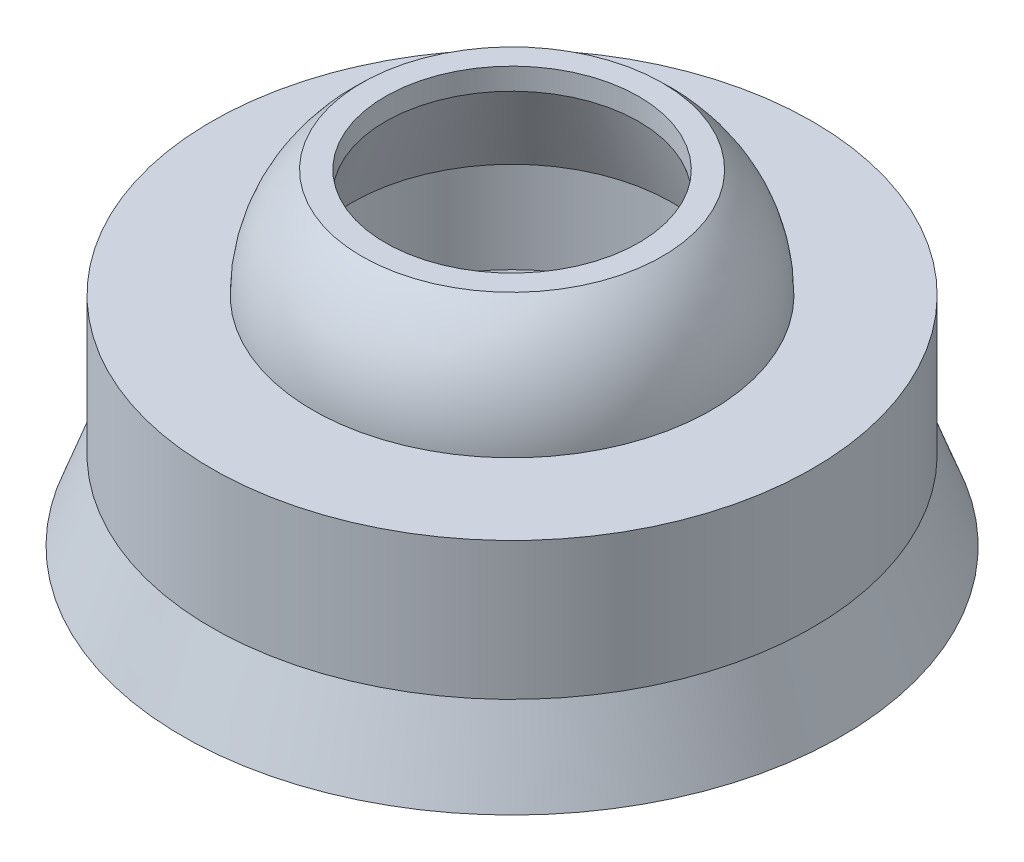
ISO-10303-21;
HEADER;
FILE_DESCRIPTION(('STEP AP214'),'2;1');
FILE_NAME('part.step','',(''),(''),'','','');
FILE_SCHEMA(('AUTOMOTIVE_DESIGN { 1 0 10303 214 1 1 1 1 }'));
ENDSEC;
DATA;
#1=APPLICATION_CONTEXT('core data for automotive mechanical design processes');
#2=APPLICATION_PROTOCOL_DEFINITION('international standard','automotive_design',2000,#1);
#3=PRODUCT_CONTEXT('',#1,'mechanical');
#4=PRODUCT('Part','Part','',(#3));
#5=PRODUCT_RELATED_PRODUCT_CATEGORY('part','',(#4));
#6=PRODUCT_DEFINITION_FORMATION('','',#4);
#7=PRODUCT_DEFINITION_CONTEXT('part definition',#1,'design');
#8=PRODUCT_DEFINITION('design','',#6,#7);
#9=PRODUCT_DEFINITION_SHAPE('','',#8);
#10=(LENGTH_UNIT() NAMED_UNIT(*) SI_UNIT(.MILLI.,.METRE.));
#11=(NAMED_UNIT(*) PLANE_ANGLE_UNIT() SI_UNIT($,.RADIAN.));
#12=(NAMED_UNIT(*) SI_UNIT($,.STERADIAN.) SOLID_ANGLE_UNIT());
#13=UNCERTAINTY_MEASURE_WITH_UNIT(LENGTH_MEASURE(1.E-05),#10,'distance_accuracy_value','');
#14=(GEOMETRIC_REPRESENTATION_CONTEXT(3) GLOBAL_UNCERTAINTY_ASSIGNED_CONTEXT((#13)) GLOBAL_UNIT_ASSIGNED_CONTEXT((#10,
#11,#12)) REPRESENTATION_CONTEXT('',''));
#15=CARTESIAN_POINT('',(0.,0.,0.));
#16=DIRECTION('',(0.,0.,1.));
#17=DIRECTION('',(1.,0.,0.));
#18=AXIS2_PLACEMENT_3D('',#15,#16,#17);
#19=CARTESIAN_POINT('',(0.,-1.9,0.));
#20=DIRECTION('',(0.,-1.,0.));
#21=DIRECTION('',(0.,0.,-1.));
#22=AXIS2_PLACEMENT_3D('',#19,#20,#21);
#23=CONICAL_SURFACE('',#22,4.15,0.348771003583907);
#24=CARTESIAN_POINT('',(0.,-3.,0.));
#25=DIRECTION('',(0.,-1.,0.));
#26=DIRECTION('',(0.,0.,-1.));
#27=AXIS2_PLACEMENT_3D('',#24,#25,#26);
#28=CIRCLE('',#27,4.55);
#29=CARTESIAN_POINT('',(0.,-3.,-4.55));
#30=VERTEX_POINT('',#29);
#31=EDGE_CURVE('E78',#30,#30,#28,.T.);
#32=ORIENTED_EDGE('',*,*,#31,.F.);
#33=EDGE_LOOP('',(#32));
#34=FACE_BOUND('',#33,.T.);
#35=CARTESIAN_POINT('',(0.,-1.9,0.));
#36=DIRECTION('',(0.,-1.,0.));
#37=DIRECTION('',(0.,0.,-1.));
#38=AXIS2_PLACEMENT_3D('',#35,#36,#37);
#39=CIRCLE('',#38,4.15);
#40=CARTESIAN_POINT('',(0.,-1.9,-4.15));
#41=VERTEX_POINT('',#40);
#42=EDGE_CURVE('E10',#41,#41,#39,.T.);
#43=ORIENTED_EDGE('',*,*,#42,.T.);
#44=EDGE_LOOP('',(#43));
#45=FACE_BOUND('',#44,.T.);
#46=ADVANCED_FACE('F32',(#34,#45),#23,.T.);
#47=CARTESIAN_POINT('',(0.,0.,0.));
#48=DIRECTION('',(0.,-1.,0.));
#49=DIRECTION('',(0.,0.,-1.));
#50=AXIS2_PLACEMENT_3D('',#47,#48,#49);
#51=CYLINDRICAL_SURFACE('',#50,4.15);
#52=ORIENTED_EDGE('',*,*,#42,.F.);
#53=EDGE_LOOP('',(#52));
#54=FACE_BOUND('',#53,.T.);
#55=CARTESIAN_POINT('',(0.,0.,0.));
#56=DIRECTION('',(0.,-1.,0.));
#57=DIRECTION('',(0.,0.,-1.));
#58=AXIS2_PLACEMENT_3D('',#55,#56,#57);
#59=CIRCLE('',#58,4.15);
#60=CARTESIAN_POINT('',(0.,0.,-4.15));
#61=VERTEX_POINT('',#60);
#62=EDGE_CURVE('E38',#61,#61,#59,.T.);
#63=ORIENTED_EDGE('',*,*,#62,.T.);
#64=EDGE_LOOP('',(#63));
#65=FACE_BOUND('',#64,.T.);
#66=ADVANCED_FACE('F85',(#54,#65),#51,.T.);
#67=CARTESIAN_POINT('',(0.,0.,4.15));
#68=DIRECTION('',(0.,-1.,0.));
#69=DIRECTION('',(0.,0.,-1.));
#70=AXIS2_PLACEMENT_3D('',#67,#68,#69);
#71=PLANE('',#70);
#72=ORIENTED_EDGE('',*,*,#62,.F.);
#73=EDGE_LOOP('',(#72));
#74=FACE_BOUND('',#73,.T.);
#75=CARTESIAN_POINT('',(0.,0.,0.));
#76=DIRECTION('',(0.,-1.,0.));
#77=DIRECTION('',(0.,0.,-1.));
#78=AXIS2_PLACEMENT_3D('',#75,#76,#77);
#79=CIRCLE('',#78,2.75212434446771);
#80=CARTESIAN_POINT('',(0.,0.,-2.75212434446771));
#81=VERTEX_POINT('',#80);
#82=EDGE_CURVE('E42',#81,#81,#79,.T.);
#83=ORIENTED_EDGE('',*,*,#82,.T.);
#84=EDGE_LOOP('',(#83));
#85=FACE_BOUND('',#84,.T.);
#86=ADVANCED_FACE('F89',(#74,#85),#71,.F.);
#87=CARTESIAN_POINT('',(0.,0.,0.));
#88=DIRECTION('',(0.,-1.,0.));
#89=DIRECTION('',(0.,0.,-1.));
#90=AXIS2_PLACEMENT_3D('',#87,#88,#89);
#91=DEGENERATE_TOROIDAL_SURFACE('',#90,0.752124344467705,2.,.T.);
#92=ORIENTED_EDGE('',*,*,#82,.F.);
#93=EDGE_LOOP('',(#92));
#94=FACE_BOUND('',#93,.T.);
#95=CARTESIAN_POINT('',(0.,1.5,0.));
#96=DIRECTION('',(0.,-1.,0.));
#97=DIRECTION('',(0.,0.,-1.));
#98=AXIS2_PLACEMENT_3D('',#95,#96,#97);
#99=CIRCLE('',#98,2.075);
#100=CARTESIAN_POINT('',(0.,1.5,-2.075));
#101=VERTEX_POINT('',#100);
#102=EDGE_CURVE('E46',#101,#101,#99,.T.);
#103=ORIENTED_EDGE('',*,*,#102,.T.);
#104=EDGE_LOOP('',(#103));
#105=FACE_BOUND('',#104,.T.);
#106=ADVANCED_FACE('F94',(#94,#105),#91,.T.);
#107=CARTESIAN_POINT('',(0.,1.5,2.075));
#108=DIRECTION('',(0.,-1.,0.));
#109=DIRECTION('',(0.,0.,-1.));
#110=AXIS2_PLACEMENT_3D('',#107,#108,#109);
#111=PLANE('',#110);
#112=ORIENTED_EDGE('',*,*,#102,.F.);
#113=EDGE_LOOP('',(#112));
#114=FACE_BOUND('',#113,.T.);
#115=CARTESIAN_POINT('',(0.,1.5,0.));
#116=DIRECTION('',(0.,-1.,0.));
#117=DIRECTION('',(0.,0.,-1.));
#118=AXIS2_PLACEMENT_3D('',#115,#116,#117);
#119=CIRCLE('',#118,1.75);
#120=CARTESIAN_POINT('',(0.,1.5,-1.75));
#121=VERTEX_POINT('',#120);
#122=EDGE_CURVE('E51',#121,#121,#119,.T.);
#123=ORIENTED_EDGE('',*,*,#122,.T.);
#124=EDGE_LOOP('',(#123));
#125=FACE_BOUND('',#124,.T.);
#126=ADVANCED_FACE('F100',(#114,#125),#111,.F.);
#127=CARTESIAN_POINT('',(0.,0.,0.));
#128=DIRECTION('',(0.,-1.,0.));
#129=DIRECTION('',(0.,0.,-1.));
#130=AXIS2_PLACEMENT_3D('',#127,#128,#129);
#131=CYLINDRICAL_SURFACE('',#130,1.75);
#132=ORIENTED_EDGE('',*,*,#122,.F.);
#133=EDGE_LOOP('',(#132));
#134=FACE_BOUND('',#133,.T.);
#135=CARTESIAN_POINT('',(0.,1.2,0.));
#136=DIRECTION('',(0.,-1.,0.));
#137=DIRECTION('',(0.,0.,-1.));
#138=AXIS2_PLACEMENT_3D('',#135,#136,#137);
#139=CIRCLE('',#138,1.75);
#140=CARTESIAN_POINT('',(0.,1.2,-1.75));
#141=VERTEX_POINT('',#140);
#142=EDGE_CURVE('E54',#141,#141,#139,.T.);
#143=ORIENTED_EDGE('',*,*,#142,.T.);
#144=EDGE_LOOP('',(#143));
#145=FACE_BOUND('',#144,.T.);
#146=ADVANCED_FACE('F104',(#134,#145),#131,.F.);
#147=CARTESIAN_POINT('',(0.,0.,0.));
#148=DIRECTION('',(0.,-1.,0.));
#149=DIRECTION('',(0.,0.,-1.));
#150=AXIS2_PLACEMENT_3D('',#147,#148,#149);
#151=CONICAL_SURFACE('',#150,2.21194690265487,0.367470305792931);
#152=ORIENTED_EDGE('',*,*,#142,.F.);
#153=EDGE_LOOP('',(#152));
#154=FACE_BOUND('',#153,.T.);
#155=CARTESIAN_POINT('',(0.,0.,0.));
#156=DIRECTION('',(0.,-1.,0.));
#157=DIRECTION('',(0.,0.,-1.));
#158=AXIS2_PLACEMENT_3D('',#155,#156,#157);
#159=CIRCLE('',#158,2.21194690265487);
#160=CARTESIAN_POINT('',(0.,0.,-2.21194690265487));
#161=VERTEX_POINT('',#160);
#162=EDGE_CURVE('E57',#161,#161,#159,.T.);
#163=ORIENTED_EDGE('',*,*,#162,.T.);
#164=EDGE_LOOP('',(#163));
#165=FACE_BOUND('',#164,.T.);
#166=ADVANCED_FACE('F108',(#154,#165),#151,.F.);
#167=CARTESIAN_POINT('',(0.,0.,0.));
#168=DIRECTION('',(0.,-1.,0.));
#169=DIRECTION('',(0.,0.,-1.));
#170=AXIS2_PLACEMENT_3D('',#167,#168,#169);
#171=CYLINDRICAL_SURFACE('',#170,2.21194690265487);
#172=ORIENTED_EDGE('',*,*,#162,.F.);
#173=EDGE_LOOP('',(#172));
#174=FACE_BOUND('',#173,.T.);
#175=CARTESIAN_POINT('',(0.,-1.26,0.));
#176=DIRECTION('',(0.,-1.,0.));
#177=DIRECTION('',(0.,0.,-1.));
#178=AXIS2_PLACEMENT_3D('',#175,#176,#177);
#179=CIRCLE('',#178,2.21194690265487);
#180=CARTESIAN_POINT('',(0.,-1.26,-2.21194690265487));
#181=VERTEX_POINT('',#180);
#182=EDGE_CURVE('E60',#181,#181,#179,.T.);
#183=ORIENTED_EDGE('',*,*,#182,.T.);
#184=EDGE_LOOP('',(#183));
#185=FACE_BOUND('',#184,.T.);
#186=ADVANCED_FACE('F112',(#174,#185),#171,.F.);
#187=CARTESIAN_POINT('',(0.,-2.13,0.));
#188=DIRECTION('',(0.,1.,0.));
#189=DIRECTION('',(0.,0.,1.));
#190=AXIS2_PLACEMENT_3D('',#187,#188,#189);
#191=CONICAL_SURFACE('',#190,1.75,0.488118247867343);
#192=ORIENTED_EDGE('',*,*,#182,.F.);
#193=EDGE_LOOP('',(#192));
#194=FACE_BOUND('',#193,.T.);
#195=CARTESIAN_POINT('',(0.,-2.13,0.));
#196=DIRECTION('',(0.,-1.,0.));
#197=DIRECTION('',(0.,0.,-1.));
#198=AXIS2_PLACEMENT_3D('',#195,#196,#197);
#199=CIRCLE('',#198,1.75);
#200=CARTESIAN_POINT('',(0.,-2.13,-1.75));
#201=VERTEX_POINT('',#200);
#202=EDGE_CURVE('E63',#201,#201,#199,.T.);
#203=ORIENTED_EDGE('',*,*,#202,.T.);
#204=EDGE_LOOP('',(#203));
#205=FACE_BOUND('',#204,.T.);
#206=ADVANCED_FACE('F116',(#194,#205),#191,.F.);
#207=CARTESIAN_POINT('',(0.,-2.63,0.));
#208=DIRECTION('',(0.,-1.,0.));
#209=DIRECTION('',(0.,0.,-1.));
#210=AXIS2_PLACEMENT_3D('',#207,#208,#209);
#211=CONICAL_SURFACE('',#210,2.25,0.785398163397449);
#212=ORIENTED_EDGE('',*,*,#202,.F.);
#213=EDGE_LOOP('',(#212));
#214=FACE_BOUND('',#213,.T.);
#215=CARTESIAN_POINT('',(0.,-2.63,0.));
#216=DIRECTION('',(0.,-1.,0.));
#217=DIRECTION('',(0.,0.,-1.));
#218=AXIS2_PLACEMENT_3D('',#215,#216,#217);
#219=CIRCLE('',#218,2.25);
#220=CARTESIAN_POINT('',(0.,-2.63,-2.25));
#221=VERTEX_POINT('',#220);
#222=EDGE_CURVE('E66',#221,#221,#219,.T.);
#223=ORIENTED_EDGE('',*,*,#222,.T.);
#224=EDGE_LOOP('',(#223));
#225=FACE_BOUND('',#224,.T.);
#226=ADVANCED_FACE('F120',(#214,#225),#211,.F.);
#227=CARTESIAN_POINT('',(0.,-1.5,0.));
#228=DIRECTION('',(0.,1.,0.));
#229=DIRECTION('',(0.,0.,1.));
#230=AXIS2_PLACEMENT_3D('',#227,#228,#229);
#231=CONICAL_SURFACE('',#230,2.85,0.488118247867343);
#232=ORIENTED_EDGE('',*,*,#222,.F.);
#233=EDGE_LOOP('',(#232));
#234=FACE_BOUND('',#233,.T.);
#235=CARTESIAN_POINT('',(0.,-1.5,0.));
#236=DIRECTION('',(0.,-1.,0.));
#237=DIRECTION('',(0.,0.,-1.));
#238=AXIS2_PLACEMENT_3D('',#235,#236,#237);
#239=CIRCLE('',#238,2.85);
#240=CARTESIAN_POINT('',(0.,-1.5,-2.85));
#241=VERTEX_POINT('',#240);
#242=EDGE_CURVE('E69',#241,#241,#239,.T.);
#243=ORIENTED_EDGE('',*,*,#242,.T.);
#244=EDGE_LOOP('',(#243));
#245=FACE_BOUND('',#244,.T.);
#246=ADVANCED_FACE('F124',(#234,#245),#231,.T.);
#247=CARTESIAN_POINT('',(0.,-1.5,2.85));
#248=DIRECTION('',(0.,1.,0.));
#249=DIRECTION('',(0.,0.,1.));
#250=AXIS2_PLACEMENT_3D('',#247,#248,#249);
#251=PLANE('',#250);
#252=ORIENTED_EDGE('',*,*,#242,.F.);
#253=EDGE_LOOP('',(#252));
#254=FACE_BOUND('',#253,.T.);
#255=CARTESIAN_POINT('',(0.,-1.5,0.));
#256=DIRECTION('',(0.,-1.,0.));
#257=DIRECTION('',(0.,0.,-1.));
#258=AXIS2_PLACEMENT_3D('',#255,#256,#257);
#259=CIRCLE('',#258,3.3);
#260=CARTESIAN_POINT('',(0.,-1.5,-3.3));
#261=VERTEX_POINT('',#260);
#262=EDGE_CURVE('E72',#261,#261,#259,.T.);
#263=ORIENTED_EDGE('',*,*,#262,.T.);
#264=EDGE_LOOP('',(#263));
#265=FACE_BOUND('',#264,.T.);
#266=ADVANCED_FACE('F128',(#254,#265),#251,.F.);
#267=CARTESIAN_POINT('',(0.,-3.,0.));
#268=DIRECTION('',(0.,-1.,0.));
#269=DIRECTION('',(0.,0.,-1.));
#270=AXIS2_PLACEMENT_3D('',#267,#268,#269);
#271=CONICAL_SURFACE('',#270,3.85,0.351444794003552);
#272=ORIENTED_EDGE('',*,*,#262,.F.);
#273=EDGE_LOOP('',(#272));
#274=FACE_BOUND('',#273,.T.);
#275=CARTESIAN_POINT('',(0.,-3.,0.));
#276=DIRECTION('',(0.,-1.,0.));
#277=DIRECTION('',(0.,0.,-1.));
#278=AXIS2_PLACEMENT_3D('',#275,#276,#277);
#279=CIRCLE('',#278,3.85);
#280=CARTESIAN_POINT('',(0.,-3.,-3.85));
#281=VERTEX_POINT('',#280);
#282=EDGE_CURVE('E75',#281,#281,#279,.T.);
#283=ORIENTED_EDGE('',*,*,#282,.T.);
#284=EDGE_LOOP('',(#283));
#285=FACE_BOUND('',#284,.T.);
#286=ADVANCED_FACE('F132',(#274,#285),#271,.F.);
#287=CARTESIAN_POINT('',(0.,-3.,4.55));
#288=DIRECTION('',(0.,1.,0.));
#289=DIRECTION('',(0.,0.,1.));
#290=AXIS2_PLACEMENT_3D('',#287,#288,#289);
#291=PLANE('',#290);
#292=ORIENTED_EDGE('',*,*,#282,.F.);
#293=EDGE_LOOP('',(#292));
#294=FACE_BOUND('',#293,.T.);
#295=ORIENTED_EDGE('',*,*,#31,.T.);
#296=EDGE_LOOP('',(#295));
#297=FACE_BOUND('',#296,.T.);
#298=ADVANCED_FACE('F82',(#294,#297),#291,.F.);
#299=CLOSED_SHELL('',(#46,#66,#86,#106,#126,#146,#166,#186,#206,#226,#246,#266,#286,#298));
#300=MANIFOLD_SOLID_BREP('B2',#299);
#301=ADVANCED_BREP_SHAPE_REPRESENTATION('',(#18,#300),#14);
#302=SHAPE_DEFINITION_REPRESENTATION(#9,#301);
ENDSEC;
END-ISO-10303-21;
